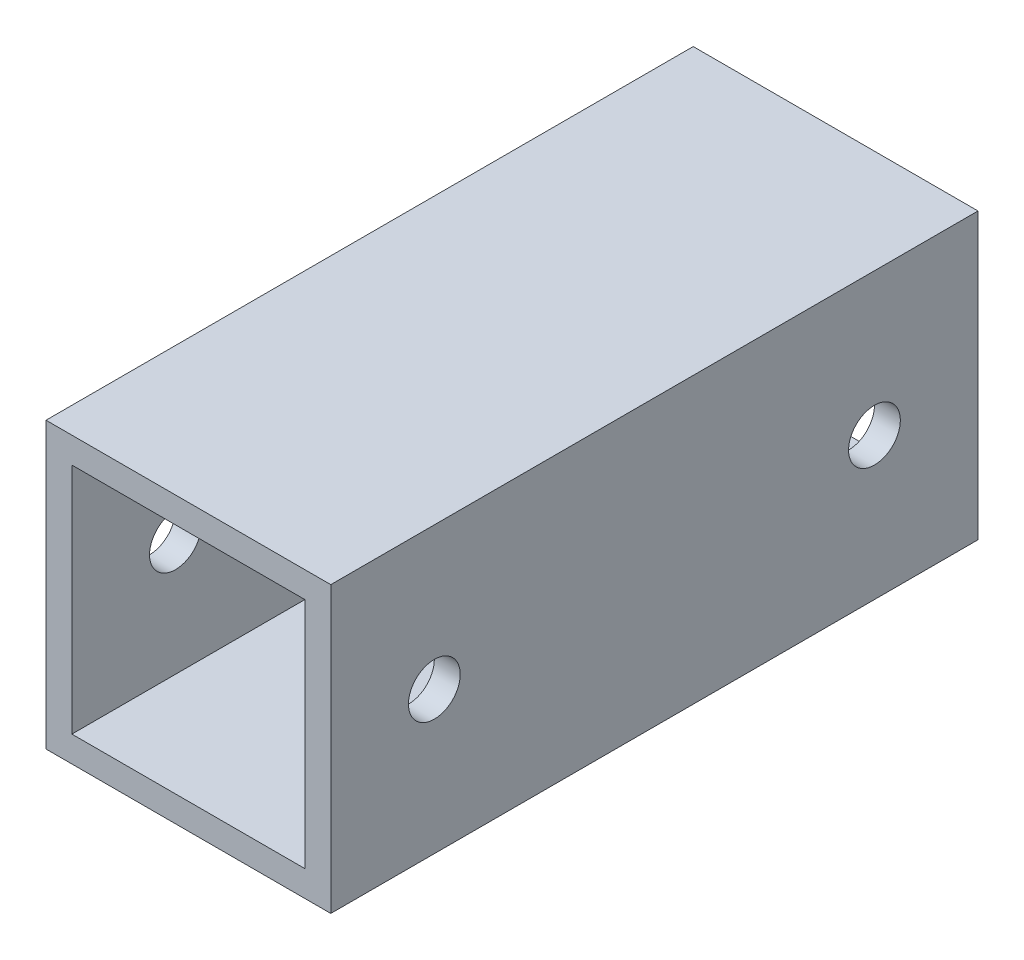
ISO-10303-21;
HEADER;
FILE_DESCRIPTION(('STEP AP214'),'2;1');
FILE_NAME('part.step','',(''),(''),'','','');
FILE_SCHEMA(('AUTOMOTIVE_DESIGN { 1 0 10303 214 1 1 1 1 }'));
ENDSEC;
DATA;
#1=APPLICATION_CONTEXT('core data for automotive mechanical design processes');
#2=APPLICATION_PROTOCOL_DEFINITION('international standard','automotive_design',2000,#1);
#3=PRODUCT_CONTEXT('',#1,'mechanical');
#4=PRODUCT('Part','Part','',(#3));
#5=PRODUCT_RELATED_PRODUCT_CATEGORY('part','',(#4));
#6=PRODUCT_DEFINITION_FORMATION('','',#4);
#7=PRODUCT_DEFINITION_CONTEXT('part definition',#1,'design');
#8=PRODUCT_DEFINITION('design','',#6,#7);
#9=PRODUCT_DEFINITION_SHAPE('','',#8);
#10=(LENGTH_UNIT() NAMED_UNIT(*) SI_UNIT(.MILLI.,.METRE.));
#11=(NAMED_UNIT(*) PLANE_ANGLE_UNIT() SI_UNIT($,.RADIAN.));
#12=(NAMED_UNIT(*) SI_UNIT($,.STERADIAN.) SOLID_ANGLE_UNIT());
#13=UNCERTAINTY_MEASURE_WITH_UNIT(LENGTH_MEASURE(1.E-05),#10,'distance_accuracy_value','');
#14=(GEOMETRIC_REPRESENTATION_CONTEXT(3) GLOBAL_UNCERTAINTY_ASSIGNED_CONTEXT((#13)) GLOBAL_UNIT_ASSIGNED_CONTEXT((#10,
#11,#12)) REPRESENTATION_CONTEXT('',''));
#15=CARTESIAN_POINT('',(0.,0.,0.));
#16=DIRECTION('',(0.,0.,1.));
#17=DIRECTION('',(1.,0.,0.));
#18=AXIS2_PLACEMENT_3D('',#15,#16,#17);
#19=CARTESIAN_POINT('',(0.,0.,50.));
#20=DIRECTION('',(0.,0.,1.));
#21=DIRECTION('',(1.,0.,0.));
#22=AXIS2_PLACEMENT_3D('',#19,#20,#21);
#23=PLANE('',#22);
#24=DIRECTION('',(0.,1.,0.));
#25=VECTOR('',#24,1.);
#26=CARTESIAN_POINT('',(22.,20.,50.));
#27=LINE('',#26,#25);
#28=CARTESIAN_POINT('',(22.,-22.,50.));
#29=VERTEX_POINT('',#28);
#30=CARTESIAN_POINT('',(22.,22.,50.));
#31=VERTEX_POINT('',#30);
#32=EDGE_CURVE('E181',#29,#31,#27,.T.);
#33=ORIENTED_EDGE('',*,*,#32,.T.);
#34=DIRECTION('',(-1.,0.,0.));
#35=VECTOR('',#34,1.);
#36=CARTESIAN_POINT('',(-20.,22.,50.));
#37=LINE('',#36,#35);
#38=CARTESIAN_POINT('',(-22.,22.,50.));
#39=VERTEX_POINT('',#38);
#40=EDGE_CURVE('E185',#31,#39,#37,.T.);
#41=ORIENTED_EDGE('',*,*,#40,.T.);
#42=DIRECTION('',(0.,-1.,0.));
#43=VECTOR('',#42,1.);
#44=CARTESIAN_POINT('',(-22.,20.,50.));
#45=LINE('',#44,#43);
#46=CARTESIAN_POINT('',(-22.,-22.,50.));
#47=VERTEX_POINT('',#46);
#48=EDGE_CURVE('E189',#39,#47,#45,.T.);
#49=ORIENTED_EDGE('',*,*,#48,.T.);
#50=DIRECTION('',(1.,0.,0.));
#51=VECTOR('',#50,1.);
#52=CARTESIAN_POINT('',(-20.,-22.,50.));
#53=LINE('',#52,#51);
#54=EDGE_CURVE('E192',#47,#29,#53,.T.);
#55=ORIENTED_EDGE('',*,*,#54,.T.);
#56=EDGE_LOOP('',(#33,#41,#49,#55));
#57=FACE_BOUND('',#56,.T.);
#58=DIRECTION('',(-1.,0.,0.));
#59=VECTOR('',#58,1.);
#60=CARTESIAN_POINT('',(-20.,18.,50.));
#61=LINE('',#60,#59);
#62=CARTESIAN_POINT('',(18.,18.,50.));
#63=VERTEX_POINT('',#62);
#64=CARTESIAN_POINT('',(-18.,18.,50.));
#65=VERTEX_POINT('',#64);
#66=EDGE_CURVE('E140',#63,#65,#61,.T.);
#67=ORIENTED_EDGE('',*,*,#66,.F.);
#68=DIRECTION('',(0.,1.,0.));
#69=VECTOR('',#68,1.);
#70=CARTESIAN_POINT('',(18.,20.,50.));
#71=LINE('',#70,#69);
#72=CARTESIAN_POINT('',(18.,-18.,50.));
#73=VERTEX_POINT('',#72);
#74=EDGE_CURVE('E131',#73,#63,#71,.T.);
#75=ORIENTED_EDGE('',*,*,#74,.F.);
#76=DIRECTION('',(1.,0.,0.));
#77=VECTOR('',#76,1.);
#78=CARTESIAN_POINT('',(-20.,-18.,50.));
#79=LINE('',#78,#77);
#80=CARTESIAN_POINT('',(-18.,-18.,50.));
#81=VERTEX_POINT('',#80);
#82=EDGE_CURVE('E157',#81,#73,#79,.T.);
#83=ORIENTED_EDGE('',*,*,#82,.F.);
#84=DIRECTION('',(0.,-1.,0.));
#85=VECTOR('',#84,1.);
#86=CARTESIAN_POINT('',(-18.,20.,50.));
#87=LINE('',#86,#85);
#88=EDGE_CURVE('E153',#65,#81,#87,.T.);
#89=ORIENTED_EDGE('',*,*,#88,.F.);
#90=EDGE_LOOP('',(#67,#75,#83,#89));
#91=FACE_BOUND('',#90,.T.);
#92=ADVANCED_FACE('F63',(#57,#91),#23,.T.);
#93=CARTESIAN_POINT('',(0.,0.,-50.));
#94=DIRECTION('',(0.,0.,1.));
#95=DIRECTION('',(1.,0.,0.));
#96=AXIS2_PLACEMENT_3D('',#93,#94,#95);
#97=PLANE('',#96);
#98=DIRECTION('',(0.,1.,0.));
#99=VECTOR('',#98,1.);
#100=CARTESIAN_POINT('',(22.,20.,-50.));
#101=LINE('',#100,#99);
#102=CARTESIAN_POINT('',(22.,-22.,-50.));
#103=VERTEX_POINT('',#102);
#104=CARTESIAN_POINT('',(22.,22.,-50.));
#105=VERTEX_POINT('',#104);
#106=EDGE_CURVE('E149',#103,#105,#101,.T.);
#107=ORIENTED_EDGE('',*,*,#106,.F.);
#108=DIRECTION('',(1.,0.,0.));
#109=VECTOR('',#108,1.);
#110=CARTESIAN_POINT('',(-20.,-22.,-50.));
#111=LINE('',#110,#109);
#112=CARTESIAN_POINT('',(-22.,-22.,-50.));
#113=VERTEX_POINT('',#112);
#114=EDGE_CURVE('E186',#113,#103,#111,.T.);
#115=ORIENTED_EDGE('',*,*,#114,.F.);
#116=DIRECTION('',(0.,-1.,0.));
#117=VECTOR('',#116,1.);
#118=CARTESIAN_POINT('',(-22.,20.,-50.));
#119=LINE('',#118,#117);
#120=CARTESIAN_POINT('',(-22.,22.,-50.));
#121=VERTEX_POINT('',#120);
#122=EDGE_CURVE('E202',#121,#113,#119,.T.);
#123=ORIENTED_EDGE('',*,*,#122,.F.);
#124=DIRECTION('',(-1.,0.,0.));
#125=VECTOR('',#124,1.);
#126=CARTESIAN_POINT('',(-20.,22.,-50.));
#127=LINE('',#126,#125);
#128=EDGE_CURVE('E199',#105,#121,#127,.T.);
#129=ORIENTED_EDGE('',*,*,#128,.F.);
#130=EDGE_LOOP('',(#107,#115,#123,#129));
#131=FACE_BOUND('',#130,.T.);
#132=DIRECTION('',(0.,1.,0.));
#133=VECTOR('',#132,1.);
#134=CARTESIAN_POINT('',(18.,20.,-50.));
#135=LINE('',#134,#133);
#136=CARTESIAN_POINT('',(18.,-18.,-50.));
#137=VERTEX_POINT('',#136);
#138=CARTESIAN_POINT('',(18.,18.,-50.));
#139=VERTEX_POINT('',#138);
#140=EDGE_CURVE('E89',#137,#139,#135,.T.);
#141=ORIENTED_EDGE('',*,*,#140,.T.);
#142=DIRECTION('',(-1.,0.,0.));
#143=VECTOR('',#142,1.);
#144=CARTESIAN_POINT('',(-20.,18.,-50.));
#145=LINE('',#144,#143);
#146=CARTESIAN_POINT('',(-18.,18.,-50.));
#147=VERTEX_POINT('',#146);
#148=EDGE_CURVE('E147',#139,#147,#145,.T.);
#149=ORIENTED_EDGE('',*,*,#148,.T.);
#150=DIRECTION('',(0.,-1.,0.));
#151=VECTOR('',#150,1.);
#152=CARTESIAN_POINT('',(-18.,20.,-50.));
#153=LINE('',#152,#151);
#154=CARTESIAN_POINT('',(-18.,-18.,-50.));
#155=VERTEX_POINT('',#154);
#156=EDGE_CURVE('E168',#147,#155,#153,.T.);
#157=ORIENTED_EDGE('',*,*,#156,.T.);
#158=DIRECTION('',(1.,0.,0.));
#159=VECTOR('',#158,1.);
#160=CARTESIAN_POINT('',(-20.,-18.,-50.));
#161=LINE('',#160,#159);
#162=EDGE_CURVE('E141',#155,#137,#161,.T.);
#163=ORIENTED_EDGE('',*,*,#162,.T.);
#164=EDGE_LOOP('',(#141,#149,#157,#163));
#165=FACE_BOUND('',#164,.T.);
#166=ADVANCED_FACE('F262',(#131,#165),#97,.F.);
#167=CARTESIAN_POINT('',(22.,20.,50.));
#168=DIRECTION('',(-1.,0.,0.));
#169=DIRECTION('',(0.,-1.,0.));
#170=AXIS2_PLACEMENT_3D('',#167,#168,#169);
#171=PLANE('',#170);
#172=CARTESIAN_POINT('',(22.,0.,34.));
#173=DIRECTION('',(-1.,0.,0.));
#174=DIRECTION('',(0.,-1.,0.));
#175=AXIS2_PLACEMENT_3D('',#172,#173,#174);
#176=CIRCLE('',#175,4.);
#177=CARTESIAN_POINT('',(22.,-3.99999999999999,34.));
#178=VERTEX_POINT('',#177);
#179=EDGE_CURVE('E220',#178,#178,#176,.T.);
#180=ORIENTED_EDGE('',*,*,#179,.T.);
#181=EDGE_LOOP('',(#180));
#182=FACE_BOUND('',#181,.T.);
#183=CARTESIAN_POINT('',(22.,0.,-34.));
#184=DIRECTION('',(-1.,0.,0.));
#185=DIRECTION('',(0.,-1.,0.));
#186=AXIS2_PLACEMENT_3D('',#183,#184,#185);
#187=CIRCLE('',#186,4.00000000000001);
#188=CARTESIAN_POINT('',(22.,-4.,-34.));
#189=VERTEX_POINT('',#188);
#190=EDGE_CURVE('E234',#189,#189,#187,.T.);
#191=ORIENTED_EDGE('',*,*,#190,.T.);
#192=EDGE_LOOP('',(#191));
#193=FACE_BOUND('',#192,.T.);
#194=ORIENTED_EDGE('',*,*,#106,.T.);
#195=DIRECTION('',(0.,0.,-1.));
#196=VECTOR('',#195,1.);
#197=CARTESIAN_POINT('',(22.,22.,50.));
#198=LINE('',#197,#196);
#199=EDGE_CURVE('E12',#31,#105,#198,.T.);
#200=ORIENTED_EDGE('',*,*,#199,.F.);
#201=ORIENTED_EDGE('',*,*,#32,.F.);
#202=DIRECTION('',(0.,0.,-1.));
#203=VECTOR('',#202,1.);
#204=CARTESIAN_POINT('',(22.,-22.,50.));
#205=LINE('',#204,#203);
#206=EDGE_CURVE('E195',#29,#103,#205,.T.);
#207=ORIENTED_EDGE('',*,*,#206,.T.);
#208=EDGE_LOOP('',(#194,#200,#201,#207));
#209=FACE_BOUND('',#208,.T.);
#210=ADVANCED_FACE('F65',(#182,#193,#209),#171,.F.);
#211=CARTESIAN_POINT('',(-20.,22.,50.));
#212=DIRECTION('',(0.,-1.,0.));
#213=DIRECTION('',(0.,0.,-1.));
#214=AXIS2_PLACEMENT_3D('',#211,#212,#213);
#215=PLANE('',#214);
#216=ORIENTED_EDGE('',*,*,#128,.T.);
#217=DIRECTION('',(0.,0.,-1.));
#218=VECTOR('',#217,1.);
#219=CARTESIAN_POINT('',(-22.,22.,50.));
#220=LINE('',#219,#218);
#221=EDGE_CURVE('E73',#39,#121,#220,.T.);
#222=ORIENTED_EDGE('',*,*,#221,.F.);
#223=ORIENTED_EDGE('',*,*,#40,.F.);
#224=ORIENTED_EDGE('',*,*,#199,.T.);
#225=EDGE_LOOP('',(#216,#222,#223,#224));
#226=FACE_BOUND('',#225,.T.);
#227=ADVANCED_FACE('F288',(#226),#215,.F.);
#228=CARTESIAN_POINT('',(-22.,20.,50.));
#229=DIRECTION('',(1.,0.,0.));
#230=DIRECTION('',(0.,1.,0.));
#231=AXIS2_PLACEMENT_3D('',#228,#229,#230);
#232=PLANE('',#231);
#233=CARTESIAN_POINT('',(-22.,0.,34.));
#234=DIRECTION('',(-1.,0.,0.));
#235=DIRECTION('',(0.,-1.,0.));
#236=AXIS2_PLACEMENT_3D('',#233,#234,#235);
#237=CIRCLE('',#236,4.);
#238=CARTESIAN_POINT('',(-22.,-4.,34.));
#239=VERTEX_POINT('',#238);
#240=EDGE_CURVE('E228',#239,#239,#237,.T.);
#241=ORIENTED_EDGE('',*,*,#240,.F.);
#242=EDGE_LOOP('',(#241));
#243=FACE_BOUND('',#242,.T.);
#244=CARTESIAN_POINT('',(-22.,0.,-34.));
#245=DIRECTION('',(-1.,0.,0.));
#246=DIRECTION('',(0.,-1.,0.));
#247=AXIS2_PLACEMENT_3D('',#244,#245,#246);
#248=CIRCLE('',#247,4.00000000000001);
#249=CARTESIAN_POINT('',(-22.,-4.00000000000001,-34.));
#250=VERTEX_POINT('',#249);
#251=EDGE_CURVE('E240',#250,#250,#248,.T.);
#252=ORIENTED_EDGE('',*,*,#251,.F.);
#253=EDGE_LOOP('',(#252));
#254=FACE_BOUND('',#253,.T.);
#255=ORIENTED_EDGE('',*,*,#122,.T.);
#256=DIRECTION('',(0.,0.,-1.));
#257=VECTOR('',#256,1.);
#258=CARTESIAN_POINT('',(-22.,-22.,50.));
#259=LINE('',#258,#257);
#260=EDGE_CURVE('E210',#47,#113,#259,.T.);
#261=ORIENTED_EDGE('',*,*,#260,.F.);
#262=ORIENTED_EDGE('',*,*,#48,.F.);
#263=ORIENTED_EDGE('',*,*,#221,.T.);
#264=EDGE_LOOP('',(#255,#261,#262,#263));
#265=FACE_BOUND('',#264,.T.);
#266=ADVANCED_FACE('F285',(#243,#254,#265),#232,.F.);
#267=CARTESIAN_POINT('',(-20.,-22.,50.));
#268=DIRECTION('',(0.,1.,0.));
#269=DIRECTION('',(0.,0.,1.));
#270=AXIS2_PLACEMENT_3D('',#267,#268,#269);
#271=PLANE('',#270);
#272=ORIENTED_EDGE('',*,*,#114,.T.);
#273=ORIENTED_EDGE('',*,*,#206,.F.);
#274=ORIENTED_EDGE('',*,*,#54,.F.);
#275=ORIENTED_EDGE('',*,*,#260,.T.);
#276=EDGE_LOOP('',(#272,#273,#274,#275));
#277=FACE_BOUND('',#276,.T.);
#278=ADVANCED_FACE('F282',(#277),#271,.F.);
#279=CARTESIAN_POINT('',(18.,20.,50.));
#280=DIRECTION('',(-1.,0.,0.));
#281=DIRECTION('',(0.,-1.,0.));
#282=AXIS2_PLACEMENT_3D('',#279,#280,#281);
#283=PLANE('',#282);
#284=CARTESIAN_POINT('',(18.,0.,34.));
#285=DIRECTION('',(-1.,0.,0.));
#286=DIRECTION('',(0.,-1.,0.));
#287=AXIS2_PLACEMENT_3D('',#284,#285,#286);
#288=CIRCLE('',#287,4.);
#289=CARTESIAN_POINT('',(18.,-3.99999999999999,34.));
#290=VERTEX_POINT('',#289);
#291=EDGE_CURVE('E165',#290,#290,#288,.T.);
#292=ORIENTED_EDGE('',*,*,#291,.F.);
#293=EDGE_LOOP('',(#292));
#294=FACE_BOUND('',#293,.T.);
#295=CARTESIAN_POINT('',(18.,0.,-34.));
#296=DIRECTION('',(-1.,0.,0.));
#297=DIRECTION('',(0.,-1.,0.));
#298=AXIS2_PLACEMENT_3D('',#295,#296,#297);
#299=CIRCLE('',#298,4.00000000000001);
#300=CARTESIAN_POINT('',(18.,-4.,-34.));
#301=VERTEX_POINT('',#300);
#302=EDGE_CURVE('E219',#301,#301,#299,.T.);
#303=ORIENTED_EDGE('',*,*,#302,.F.);
#304=EDGE_LOOP('',(#303));
#305=FACE_BOUND('',#304,.T.);
#306=ORIENTED_EDGE('',*,*,#140,.F.);
#307=DIRECTION('',(0.,0.,-1.));
#308=VECTOR('',#307,1.);
#309=CARTESIAN_POINT('',(18.,-18.,50.));
#310=LINE('',#309,#308);
#311=EDGE_CURVE('E135',#73,#137,#310,.T.);
#312=ORIENTED_EDGE('',*,*,#311,.F.);
#313=ORIENTED_EDGE('',*,*,#74,.T.);
#314=DIRECTION('',(0.,0.,-1.));
#315=VECTOR('',#314,1.);
#316=CARTESIAN_POINT('',(18.,18.,50.));
#317=LINE('',#316,#315);
#318=EDGE_CURVE('E134',#63,#139,#317,.T.);
#319=ORIENTED_EDGE('',*,*,#318,.T.);
#320=EDGE_LOOP('',(#306,#312,#313,#319));
#321=FACE_BOUND('',#320,.T.);
#322=ADVANCED_FACE('F133',(#294,#305,#321),#283,.T.);
#323=CARTESIAN_POINT('',(-20.,18.,50.));
#324=DIRECTION('',(0.,-1.,0.));
#325=DIRECTION('',(0.,0.,-1.));
#326=AXIS2_PLACEMENT_3D('',#323,#324,#325);
#327=PLANE('',#326);
#328=ORIENTED_EDGE('',*,*,#148,.F.);
#329=ORIENTED_EDGE('',*,*,#318,.F.);
#330=ORIENTED_EDGE('',*,*,#66,.T.);
#331=DIRECTION('',(0.,0.,-1.));
#332=VECTOR('',#331,1.);
#333=CARTESIAN_POINT('',(-18.,18.,50.));
#334=LINE('',#333,#332);
#335=EDGE_CURVE('E150',#65,#147,#334,.T.);
#336=ORIENTED_EDGE('',*,*,#335,.T.);
#337=EDGE_LOOP('',(#328,#329,#330,#336));
#338=FACE_BOUND('',#337,.T.);
#339=ADVANCED_FACE('F144',(#338),#327,.T.);
#340=CARTESIAN_POINT('',(-18.,20.,50.));
#341=DIRECTION('',(1.,0.,0.));
#342=DIRECTION('',(0.,1.,0.));
#343=AXIS2_PLACEMENT_3D('',#340,#341,#342);
#344=PLANE('',#343);
#345=CARTESIAN_POINT('',(-18.,0.,34.));
#346=DIRECTION('',(1.,0.,0.));
#347=DIRECTION('',(0.,1.,0.));
#348=AXIS2_PLACEMENT_3D('',#345,#346,#347);
#349=CIRCLE('',#348,4.);
#350=CARTESIAN_POINT('',(-18.,3.99999999999999,34.));
#351=VERTEX_POINT('',#350);
#352=EDGE_CURVE('E67',#351,#351,#349,.T.);
#353=ORIENTED_EDGE('',*,*,#352,.F.);
#354=EDGE_LOOP('',(#353));
#355=FACE_BOUND('',#354,.T.);
#356=CARTESIAN_POINT('',(-18.,0.,-34.));
#357=DIRECTION('',(1.,0.,0.));
#358=DIRECTION('',(0.,1.,0.));
#359=AXIS2_PLACEMENT_3D('',#356,#357,#358);
#360=CIRCLE('',#359,4.00000000000001);
#361=CARTESIAN_POINT('',(-18.,4.,-34.));
#362=VERTEX_POINT('',#361);
#363=EDGE_CURVE('E216',#362,#362,#360,.T.);
#364=ORIENTED_EDGE('',*,*,#363,.F.);
#365=EDGE_LOOP('',(#364));
#366=FACE_BOUND('',#365,.T.);
#367=ORIENTED_EDGE('',*,*,#156,.F.);
#368=ORIENTED_EDGE('',*,*,#335,.F.);
#369=ORIENTED_EDGE('',*,*,#88,.T.);
#370=DIRECTION('',(0.,0.,-1.));
#371=VECTOR('',#370,1.);
#372=CARTESIAN_POINT('',(-18.,-18.,50.));
#373=LINE('',#372,#371);
#374=EDGE_CURVE('E81',#81,#155,#373,.T.);
#375=ORIENTED_EDGE('',*,*,#374,.T.);
#376=EDGE_LOOP('',(#367,#368,#369,#375));
#377=FACE_BOUND('',#376,.T.);
#378=ADVANCED_FACE('F254',(#355,#366,#377),#344,.T.);
#379=CARTESIAN_POINT('',(-20.,-18.,50.));
#380=DIRECTION('',(0.,1.,0.));
#381=DIRECTION('',(0.,0.,1.));
#382=AXIS2_PLACEMENT_3D('',#379,#380,#381);
#383=PLANE('',#382);
#384=ORIENTED_EDGE('',*,*,#162,.F.);
#385=ORIENTED_EDGE('',*,*,#374,.F.);
#386=ORIENTED_EDGE('',*,*,#82,.T.);
#387=ORIENTED_EDGE('',*,*,#311,.T.);
#388=EDGE_LOOP('',(#384,#385,#386,#387));
#389=FACE_BOUND('',#388,.T.);
#390=ADVANCED_FACE('F257',(#389),#383,.T.);
#391=CARTESIAN_POINT('',(22.,0.,-34.));
#392=DIRECTION('',(-1.,0.,0.));
#393=DIRECTION('',(0.,-1.,0.));
#394=AXIS2_PLACEMENT_3D('',#391,#392,#393);
#395=CYLINDRICAL_SURFACE('',#394,4.00000000000001);
#396=ORIENTED_EDGE('',*,*,#363,.T.);
#397=EDGE_LOOP('',(#396));
#398=FACE_BOUND('',#397,.T.);
#399=ORIENTED_EDGE('',*,*,#251,.T.);
#400=EDGE_LOOP('',(#399));
#401=FACE_BOUND('',#400,.T.);
#402=ADVANCED_FACE('F264',(#398,#401),#395,.F.);
#403=CARTESIAN_POINT('',(22.,0.,34.));
#404=DIRECTION('',(-1.,0.,0.));
#405=DIRECTION('',(0.,-1.,0.));
#406=AXIS2_PLACEMENT_3D('',#403,#404,#405);
#407=CYLINDRICAL_SURFACE('',#406,4.);
#408=ORIENTED_EDGE('',*,*,#352,.T.);
#409=EDGE_LOOP('',(#408));
#410=FACE_BOUND('',#409,.T.);
#411=ORIENTED_EDGE('',*,*,#240,.T.);
#412=EDGE_LOOP('',(#411));
#413=FACE_BOUND('',#412,.T.);
#414=ADVANCED_FACE('F251',(#410,#413),#407,.F.);
#415=ORIENTED_EDGE('',*,*,#302,.T.);
#416=EDGE_LOOP('',(#415));
#417=FACE_BOUND('',#416,.T.);
#418=ORIENTED_EDGE('',*,*,#190,.F.);
#419=EDGE_LOOP('',(#418));
#420=FACE_BOUND('',#419,.T.);
#421=ADVANCED_FACE('F270',(#417,#420),#395,.F.);
#422=ORIENTED_EDGE('',*,*,#291,.T.);
#423=EDGE_LOOP('',(#422));
#424=FACE_BOUND('',#423,.T.);
#425=ORIENTED_EDGE('',*,*,#179,.F.);
#426=EDGE_LOOP('',(#425));
#427=FACE_BOUND('',#426,.T.);
#428=ADVANCED_FACE('F313',(#424,#427),#407,.F.);
#429=CLOSED_SHELL('',(#92,#166,#210,#227,#266,#278,#322,#339,#378,#390,#402,#414,#421,#428));
#430=MANIFOLD_SOLID_BREP('B2',#429);
#431=ADVANCED_BREP_SHAPE_REPRESENTATION('',(#18,#430),#14);
#432=SHAPE_DEFINITION_REPRESENTATION(#9,#431);
ENDSEC;
END-ISO-10303-21;
